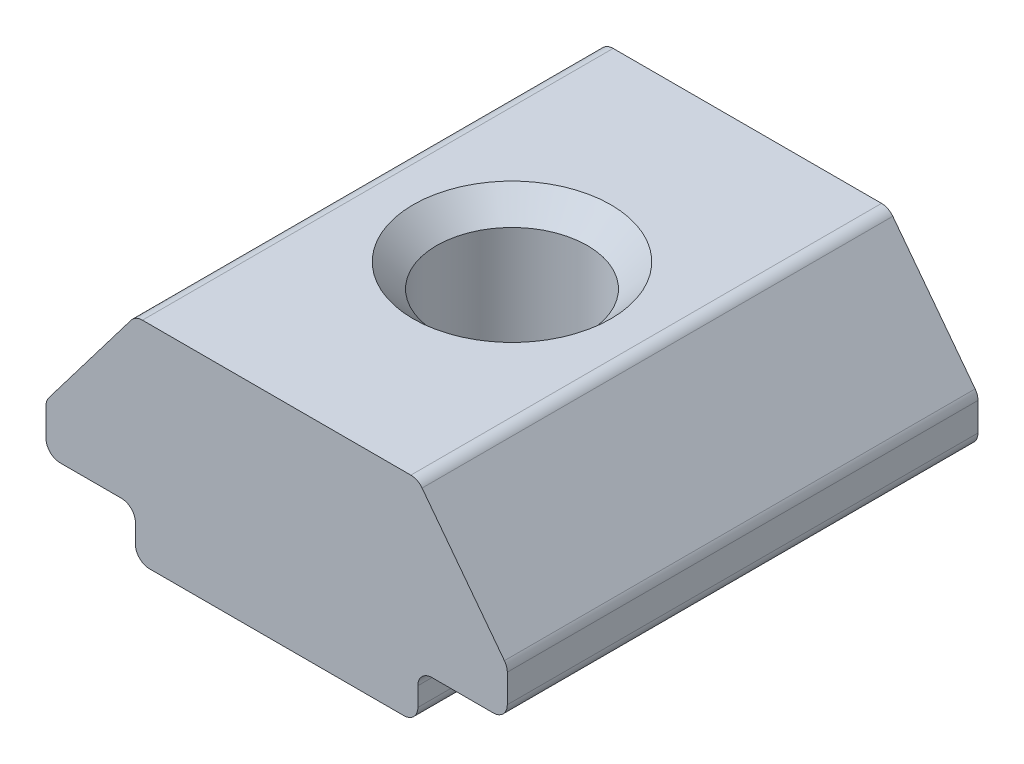
ISO-10303-21;
HEADER;
FILE_DESCRIPTION(('STEP AP214'),'2;1');
FILE_NAME('part.step','',(''),(''),'','','');
FILE_SCHEMA(('AUTOMOTIVE_DESIGN { 1 0 10303 214 1 1 1 1 }'));
ENDSEC;
DATA;
#1=APPLICATION_CONTEXT('core data for automotive mechanical design processes');
#2=APPLICATION_PROTOCOL_DEFINITION('international standard','automotive_design',2000,#1);
#3=PRODUCT_CONTEXT('',#1,'mechanical');
#4=PRODUCT('Part','Part','',(#3));
#5=PRODUCT_RELATED_PRODUCT_CATEGORY('part','',(#4));
#6=PRODUCT_DEFINITION_FORMATION('','',#4);
#7=PRODUCT_DEFINITION_CONTEXT('part definition',#1,'design');
#8=PRODUCT_DEFINITION('design','',#6,#7);
#9=PRODUCT_DEFINITION_SHAPE('','',#8);
#10=(LENGTH_UNIT() NAMED_UNIT(*) SI_UNIT(.MILLI.,.METRE.));
#11=(NAMED_UNIT(*) PLANE_ANGLE_UNIT() SI_UNIT($,.RADIAN.));
#12=(NAMED_UNIT(*) SI_UNIT($,.STERADIAN.) SOLID_ANGLE_UNIT());
#13=UNCERTAINTY_MEASURE_WITH_UNIT(LENGTH_MEASURE(1.E-05),#10,'distance_accuracy_value','');
#14=(GEOMETRIC_REPRESENTATION_CONTEXT(3) GLOBAL_UNCERTAINTY_ASSIGNED_CONTEXT((#13)) GLOBAL_UNIT_ASSIGNED_CONTEXT((#10,
#11,#12)) REPRESENTATION_CONTEXT('',''));
#15=CARTESIAN_POINT('',(0.,0.,0.));
#16=DIRECTION('',(0.,0.,1.));
#17=DIRECTION('',(1.,0.,0.));
#18=AXIS2_PLACEMENT_3D('',#15,#16,#17);
#19=CARTESIAN_POINT('',(-95.2464548456219,-68.7330433621878,164.718531206181));
#20=DIRECTION('',(1.,0.,0.));
#21=DIRECTION('',(0.,0.,-1.));
#22=AXIS2_PLACEMENT_3D('',#19,#20,#21);
#23=PLANE('',#22);
#24=DIRECTION('',(0.,-1.,0.));
#25=VECTOR('',#24,1.);
#26=CARTESIAN_POINT('',(-95.2464548456219,-68.7330433621878,154.718531206181));
#27=LINE('',#26,#25);
#28=CARTESIAN_POINT('',(-95.2464548456219,-69.0330433621878,154.718531206181));
#29=VERTEX_POINT('',#28);
#30=CARTESIAN_POINT('',(-95.2464548456219,-69.4330433621878,154.718531206181));
#31=VERTEX_POINT('',#30);
#32=EDGE_CURVE('E314',#29,#31,#27,.T.);
#33=ORIENTED_EDGE('',*,*,#32,.T.);
#34=DIRECTION('',(0.,0.,-1.));
#35=VECTOR('',#34,1.);
#36=CARTESIAN_POINT('',(-95.2464548456219,-69.4330433621878,164.718531206181));
#37=LINE('',#36,#35);
#38=CARTESIAN_POINT('',(-95.2464548456219,-69.4330433621878,164.718531206181));
#39=VERTEX_POINT('',#38);
#40=EDGE_CURVE('E39',#31,#39,#37,.F.);
#41=ORIENTED_EDGE('',*,*,#40,.T.);
#42=DIRECTION('',(0.,-1.,0.));
#43=VECTOR('',#42,1.);
#44=CARTESIAN_POINT('',(-95.2464548456219,-68.7330433621878,164.718531206181));
#45=LINE('',#44,#43);
#46=CARTESIAN_POINT('',(-95.2464548456219,-69.0330433621878,164.718531206181));
#47=VERTEX_POINT('',#46);
#48=EDGE_CURVE('E183',#47,#39,#45,.T.);
#49=ORIENTED_EDGE('',*,*,#48,.F.);
#50=DIRECTION('',(0.,0.,-1.));
#51=VECTOR('',#50,1.);
#52=CARTESIAN_POINT('',(-95.2464548456219,-69.0330433621878,154.718531206181));
#53=LINE('',#52,#51);
#54=EDGE_CURVE('E257',#47,#29,#53,.T.);
#55=ORIENTED_EDGE('',*,*,#54,.T.);
#56=EDGE_LOOP('',(#33,#41,#49,#55));
#57=FACE_BOUND('',#56,.T.);
#58=ADVANCED_FACE('F16',(#57),#23,.F.);
#59=CARTESIAN_POINT('',(-95.2464548456219,-69.7330433621878,164.718531206181));
#60=DIRECTION('',(0.,1.,0.));
#61=DIRECTION('',(0.,0.,1.));
#62=AXIS2_PLACEMENT_3D('',#59,#60,#61);
#63=PLANE('',#62);
#64=CARTESIAN_POINT('',(-92.2464548456219,-69.7330433621878,159.718531206181));
#65=DIRECTION('',(0.,1.,0.));
#66=DIRECTION('',(0.,0.,1.));
#67=AXIS2_PLACEMENT_3D('',#64,#65,#66);
#68=CIRCLE('',#67,2.1);
#69=CARTESIAN_POINT('',(-92.2464548456219,-69.7330433621878,161.818531206181));
#70=VERTEX_POINT('',#69);
#71=EDGE_CURVE('E10',#70,#70,#68,.T.);
#72=ORIENTED_EDGE('',*,*,#71,.T.);
#73=EDGE_LOOP('',(#72));
#74=FACE_BOUND('',#73,.T.);
#75=DIRECTION('',(1.,0.,0.));
#76=VECTOR('',#75,1.);
#77=CARTESIAN_POINT('',(-95.2464548456219,-69.7330433621878,154.718531206181));
#78=LINE('',#77,#76);
#79=CARTESIAN_POINT('',(-94.9464548456219,-69.7330433621878,154.718531206181));
#80=VERTEX_POINT('',#79);
#81=CARTESIAN_POINT('',(-89.5464548456219,-69.7330433621878,154.718531206181));
#82=VERTEX_POINT('',#81);
#83=EDGE_CURVE('E308',#80,#82,#78,.T.);
#84=ORIENTED_EDGE('',*,*,#83,.T.);
#85=DIRECTION('',(0.,0.,-1.));
#86=VECTOR('',#85,1.);
#87=CARTESIAN_POINT('',(-89.5464548456219,-69.7330433621878,164.718531206181));
#88=LINE('',#87,#86);
#89=CARTESIAN_POINT('',(-89.5464548456219,-69.7330433621878,164.718531206181));
#90=VERTEX_POINT('',#89);
#91=EDGE_CURVE('E251',#82,#90,#88,.F.);
#92=ORIENTED_EDGE('',*,*,#91,.T.);
#93=DIRECTION('',(1.,0.,0.));
#94=VECTOR('',#93,1.);
#95=CARTESIAN_POINT('',(-95.2464548456219,-69.7330433621878,164.718531206181));
#96=LINE('',#95,#94);
#97=CARTESIAN_POINT('',(-94.9464548456219,-69.7330433621878,164.718531206181));
#98=VERTEX_POINT('',#97);
#99=EDGE_CURVE('E186',#98,#90,#96,.T.);
#100=ORIENTED_EDGE('',*,*,#99,.F.);
#101=DIRECTION('',(0.,0.,-1.));
#102=VECTOR('',#101,1.);
#103=CARTESIAN_POINT('',(-94.9464548456219,-69.7330433621878,164.718531206181));
#104=LINE('',#103,#102);
#105=EDGE_CURVE('E248',#98,#80,#104,.T.);
#106=ORIENTED_EDGE('',*,*,#105,.T.);
#107=EDGE_LOOP('',(#84,#92,#100,#106));
#108=FACE_BOUND('',#107,.T.);
#109=ADVANCED_FACE('F301',(#74,#108),#63,.F.);
#110=CARTESIAN_POINT('',(-89.2464548456219,-69.7330433621878,164.718531206181));
#111=DIRECTION('',(-1.,0.,0.));
#112=DIRECTION('',(0.,0.,1.));
#113=AXIS2_PLACEMENT_3D('',#110,#111,#112);
#114=PLANE('',#113);
#115=DIRECTION('',(0.,1.,0.));
#116=VECTOR('',#115,1.);
#117=CARTESIAN_POINT('',(-89.2464548456219,-69.7330433621878,164.718531206181));
#118=LINE('',#117,#116);
#119=CARTESIAN_POINT('',(-89.2464548456219,-69.4330433621878,164.718531206181));
#120=VERTEX_POINT('',#119);
#121=CARTESIAN_POINT('',(-89.2464548456219,-69.0330433621878,164.718531206181));
#122=VERTEX_POINT('',#121);
#123=EDGE_CURVE('E321',#120,#122,#118,.T.);
#124=ORIENTED_EDGE('',*,*,#123,.F.);
#125=DIRECTION('',(0.,0.,-1.));
#126=VECTOR('',#125,1.);
#127=CARTESIAN_POINT('',(-89.2464548456219,-69.4330433621878,164.718531206181));
#128=LINE('',#127,#126);
#129=CARTESIAN_POINT('',(-89.2464548456219,-69.4330433621878,154.718531206181));
#130=VERTEX_POINT('',#129);
#131=EDGE_CURVE('E241',#120,#130,#128,.T.);
#132=ORIENTED_EDGE('',*,*,#131,.T.);
#133=DIRECTION('',(0.,1.,0.));
#134=VECTOR('',#133,1.);
#135=CARTESIAN_POINT('',(-89.2464548456219,-69.7330433621878,154.718531206181));
#136=LINE('',#135,#134);
#137=CARTESIAN_POINT('',(-89.2464548456219,-69.0330433621878,154.718531206181));
#138=VERTEX_POINT('',#137);
#139=EDGE_CURVE('E313',#130,#138,#136,.T.);
#140=ORIENTED_EDGE('',*,*,#139,.T.);
#141=DIRECTION('',(0.,0.,-1.));
#142=VECTOR('',#141,1.);
#143=CARTESIAN_POINT('',(-89.2464548456219,-69.0330433621878,164.718531206181));
#144=LINE('',#143,#142);
#145=EDGE_CURVE('E239',#138,#122,#144,.F.);
#146=ORIENTED_EDGE('',*,*,#145,.T.);
#147=EDGE_LOOP('',(#124,#132,#140,#146));
#148=FACE_BOUND('',#147,.T.);
#149=ADVANCED_FACE('F304',(#148),#114,.F.);
#150=CARTESIAN_POINT('',(-89.2464548456219,-68.7330433621878,164.718531206181));
#151=DIRECTION('',(0.,1.,0.));
#152=DIRECTION('',(0.,0.,1.));
#153=AXIS2_PLACEMENT_3D('',#150,#151,#152);
#154=PLANE('',#153);
#155=DIRECTION('',(1.,0.,0.));
#156=VECTOR('',#155,1.);
#157=CARTESIAN_POINT('',(-89.2464548456219,-68.7330433621878,164.718531206181));
#158=LINE('',#157,#156);
#159=CARTESIAN_POINT('',(-88.9464548456219,-68.7330433621878,164.718531206181));
#160=VERTEX_POINT('',#159);
#161=CARTESIAN_POINT('',(-87.6464548456219,-68.7330433621878,164.718531206181));
#162=VERTEX_POINT('',#161);
#163=EDGE_CURVE('E325',#160,#162,#158,.T.);
#164=ORIENTED_EDGE('',*,*,#163,.F.);
#165=DIRECTION('',(0.,0.,-1.));
#166=VECTOR('',#165,1.);
#167=CARTESIAN_POINT('',(-88.9464548456219,-68.7330433621878,154.718531206181));
#168=LINE('',#167,#166);
#169=CARTESIAN_POINT('',(-88.9464548456219,-68.7330433621878,154.718531206181));
#170=VERTEX_POINT('',#169);
#171=EDGE_CURVE('E261',#160,#170,#168,.T.);
#172=ORIENTED_EDGE('',*,*,#171,.T.);
#173=DIRECTION('',(1.,0.,0.));
#174=VECTOR('',#173,1.);
#175=CARTESIAN_POINT('',(-89.2464548456219,-68.7330433621878,154.718531206181));
#176=LINE('',#175,#174);
#177=CARTESIAN_POINT('',(-87.6464548456219,-68.7330433621878,154.718531206181));
#178=VERTEX_POINT('',#177);
#179=EDGE_CURVE('E348',#170,#178,#176,.T.);
#180=ORIENTED_EDGE('',*,*,#179,.T.);
#181=DIRECTION('',(0.,0.,-1.));
#182=VECTOR('',#181,1.);
#183=CARTESIAN_POINT('',(-87.6464548456219,-68.7330433621878,164.718531206181));
#184=LINE('',#183,#182);
#185=EDGE_CURVE('E236',#178,#162,#184,.F.);
#186=ORIENTED_EDGE('',*,*,#185,.T.);
#187=EDGE_LOOP('',(#164,#172,#180,#186));
#188=FACE_BOUND('',#187,.T.);
#189=ADVANCED_FACE('F549',(#188),#154,.F.);
#190=CARTESIAN_POINT('',(-87.3464548456219,-68.7330433621878,164.718531206181));
#191=DIRECTION('',(-1.,0.,0.));
#192=DIRECTION('',(0.,0.,1.));
#193=AXIS2_PLACEMENT_3D('',#190,#191,#192);
#194=PLANE('',#193);
#195=DIRECTION('',(0.,1.,0.));
#196=VECTOR('',#195,1.);
#197=CARTESIAN_POINT('',(-87.3464548456219,-68.7330433621878,154.718531206181));
#198=LINE('',#197,#196);
#199=CARTESIAN_POINT('',(-87.3464548456219,-68.4330433621878,154.718531206181));
#200=VERTEX_POINT('',#199);
#201=CARTESIAN_POINT('',(-87.3464548456219,-67.8341060506544,154.718531206181));
#202=VERTEX_POINT('',#201);
#203=EDGE_CURVE('E350',#200,#202,#198,.T.);
#204=ORIENTED_EDGE('',*,*,#203,.T.);
#205=DIRECTION('',(0.,0.,-1.));
#206=VECTOR('',#205,1.);
#207=CARTESIAN_POINT('',(-87.3464548456219,-67.8341060506544,164.718531206181));
#208=LINE('',#207,#206);
#209=CARTESIAN_POINT('',(-87.3464548456219,-67.8341060506544,164.718531206181));
#210=VERTEX_POINT('',#209);
#211=EDGE_CURVE('E234',#202,#210,#208,.F.);
#212=ORIENTED_EDGE('',*,*,#211,.T.);
#213=DIRECTION('',(0.,1.,0.));
#214=VECTOR('',#213,1.);
#215=CARTESIAN_POINT('',(-87.3464548456219,-68.7330433621878,164.718531206181));
#216=LINE('',#215,#214);
#217=CARTESIAN_POINT('',(-87.3464548456219,-68.4330433621878,164.718531206181));
#218=VERTEX_POINT('',#217);
#219=EDGE_CURVE('E327',#218,#210,#216,.T.);
#220=ORIENTED_EDGE('',*,*,#219,.F.);
#221=DIRECTION('',(0.,0.,-1.));
#222=VECTOR('',#221,1.);
#223=CARTESIAN_POINT('',(-87.3464548456219,-68.4330433621878,164.718531206181));
#224=LINE('',#223,#222);
#225=EDGE_CURVE('E231',#218,#200,#224,.T.);
#226=ORIENTED_EDGE('',*,*,#225,.T.);
#227=EDGE_LOOP('',(#204,#212,#220,#226));
#228=FACE_BOUND('',#227,.T.);
#229=ADVANCED_FACE('F540',(#228),#194,.F.);
#230=CARTESIAN_POINT('',(-87.3464548456219,-67.7330433621878,164.718531206181));
#231=DIRECTION('',(-0.796162194123102,-0.605083267533558,0.));
#232=DIRECTION('',(0.605083267533558,-0.796162194123102,0.));
#233=AXIS2_PLACEMENT_3D('',#230,#231,#232);
#234=PLANE('',#233);
#235=DIRECTION('',(-0.605083267533558,0.796162194123102,0.));
#236=VECTOR('',#235,1.);
#237=CARTESIAN_POINT('',(-87.3464548456219,-67.7330433621878,154.718531206181));
#238=LINE('',#237,#236);
#239=CARTESIAN_POINT('',(-87.407606187385,-67.6525810703943,154.718531206181));
#240=VERTEX_POINT('',#239);
#241=CARTESIAN_POINT('',(-89.1564138306195,-65.3515183819277,154.718531206181));
#242=VERTEX_POINT('',#241);
#243=EDGE_CURVE('E353',#240,#242,#238,.T.);
#244=ORIENTED_EDGE('',*,*,#243,.T.);
#245=DIRECTION('',(0.,0.,-1.));
#246=VECTOR('',#245,1.);
#247=CARTESIAN_POINT('',(-89.1564138306195,-65.3515183819277,164.718531206181));
#248=LINE('',#247,#246);
#249=CARTESIAN_POINT('',(-89.1564138306195,-65.3515183819277,164.718531206181));
#250=VERTEX_POINT('',#249);
#251=EDGE_CURVE('E229',#242,#250,#248,.F.);
#252=ORIENTED_EDGE('',*,*,#251,.T.);
#253=DIRECTION('',(-0.605083267533558,0.796162194123102,0.));
#254=VECTOR('',#253,1.);
#255=CARTESIAN_POINT('',(-87.3464548456219,-67.7330433621878,164.718531206181));
#256=LINE('',#255,#254);
#257=CARTESIAN_POINT('',(-87.407606187385,-67.6525810703943,164.718531206181));
#258=VERTEX_POINT('',#257);
#259=EDGE_CURVE('E333',#258,#250,#256,.T.);
#260=ORIENTED_EDGE('',*,*,#259,.F.);
#261=DIRECTION('',(0.,0.,-1.));
#262=VECTOR('',#261,1.);
#263=CARTESIAN_POINT('',(-87.407606187385,-67.6525810703943,164.718531206181));
#264=LINE('',#263,#262);
#265=EDGE_CURVE('E226',#258,#240,#264,.T.);
#266=ORIENTED_EDGE('',*,*,#265,.T.);
#267=EDGE_LOOP('',(#244,#252,#260,#266));
#268=FACE_BOUND('',#267,.T.);
#269=ADVANCED_FACE('F532',(#268),#234,.F.);
#270=CARTESIAN_POINT('',(-89.2464548456219,-65.2330433621878,164.718531206181));
#271=DIRECTION('',(0.,-1.,0.));
#272=DIRECTION('',(0.,0.,-1.));
#273=AXIS2_PLACEMENT_3D('',#270,#271,#272);
#274=PLANE('',#273);
#275=CARTESIAN_POINT('',(-92.2464548456219,-65.2330433621878,159.718531206181));
#276=DIRECTION('',(0.,-1.,0.));
#277=DIRECTION('',(0.,0.,-1.));
#278=AXIS2_PLACEMENT_3D('',#275,#276,#277);
#279=CIRCLE('',#278,2.10000000000001);
#280=CARTESIAN_POINT('',(-92.2464548456219,-65.2330433621878,157.618531206181));
#281=VERTEX_POINT('',#280);
#282=EDGE_CURVE('E24',#281,#281,#279,.T.);
#283=ORIENTED_EDGE('',*,*,#282,.T.);
#284=EDGE_LOOP('',(#283));
#285=FACE_BOUND('',#284,.T.);
#286=DIRECTION('',(-1.,0.,0.));
#287=VECTOR('',#286,1.);
#288=CARTESIAN_POINT('',(-89.2464548456219,-65.2330433621878,154.718531206181));
#289=LINE('',#288,#287);
#290=CARTESIAN_POINT('',(-89.3952624888565,-65.2330433621878,154.718531206181));
#291=VERTEX_POINT('',#290);
#292=CARTESIAN_POINT('',(-95.0976472023873,-65.2330433621878,154.718531206181));
#293=VERTEX_POINT('',#292);
#294=EDGE_CURVE('E356',#291,#293,#289,.T.);
#295=ORIENTED_EDGE('',*,*,#294,.T.);
#296=DIRECTION('',(0.,0.,-1.));
#297=VECTOR('',#296,1.);
#298=CARTESIAN_POINT('',(-95.0976472023873,-65.2330433621878,164.718531206181));
#299=LINE('',#298,#297);
#300=CARTESIAN_POINT('',(-95.0976472023873,-65.2330433621878,164.718531206181));
#301=VERTEX_POINT('',#300);
#302=EDGE_CURVE('E224',#293,#301,#299,.F.);
#303=ORIENTED_EDGE('',*,*,#302,.T.);
#304=DIRECTION('',(-1.,0.,0.));
#305=VECTOR('',#304,1.);
#306=CARTESIAN_POINT('',(-89.2464548456219,-65.2330433621878,164.718531206181));
#307=LINE('',#306,#305);
#308=CARTESIAN_POINT('',(-89.3952624888565,-65.2330433621878,164.718531206181));
#309=VERTEX_POINT('',#308);
#310=EDGE_CURVE('E336',#309,#301,#307,.T.);
#311=ORIENTED_EDGE('',*,*,#310,.F.);
#312=DIRECTION('',(0.,0.,-1.));
#313=VECTOR('',#312,1.);
#314=CARTESIAN_POINT('',(-89.3952624888565,-65.2330433621878,164.718531206181));
#315=LINE('',#314,#313);
#316=EDGE_CURVE('E221',#309,#291,#315,.T.);
#317=ORIENTED_EDGE('',*,*,#316,.T.);
#318=EDGE_LOOP('',(#295,#303,#311,#317));
#319=FACE_BOUND('',#318,.T.);
#320=ADVANCED_FACE('F280',(#285,#319),#274,.F.);
#321=CARTESIAN_POINT('',(-97.1464548456219,-67.7330433621878,164.718531206181));
#322=DIRECTION('',(0.796162194123102,-0.605083267533558,0.));
#323=DIRECTION('',(0.605083267533558,0.796162194123102,0.));
#324=AXIS2_PLACEMENT_3D('',#321,#322,#323);
#325=PLANE('',#324);
#326=DIRECTION('',(-0.605083267533558,-0.796162194123102,0.));
#327=VECTOR('',#326,1.);
#328=CARTESIAN_POINT('',(-97.1464548456219,-67.7330433621878,154.718531206181));
#329=LINE('',#328,#327);
#330=CARTESIAN_POINT('',(-95.3364958606242,-65.3515183819277,154.718531206181));
#331=VERTEX_POINT('',#330);
#332=CARTESIAN_POINT('',(-97.0853035038588,-67.6525810703943,154.718531206181));
#333=VERTEX_POINT('',#332);
#334=EDGE_CURVE('E188',#331,#333,#329,.T.);
#335=ORIENTED_EDGE('',*,*,#334,.T.);
#336=DIRECTION('',(0.,0.,-1.));
#337=VECTOR('',#336,1.);
#338=CARTESIAN_POINT('',(-97.0853035038588,-67.6525810703943,164.718531206181));
#339=LINE('',#338,#337);
#340=CARTESIAN_POINT('',(-97.0853035038588,-67.6525810703943,164.718531206181));
#341=VERTEX_POINT('',#340);
#342=EDGE_CURVE('E219',#333,#341,#339,.F.);
#343=ORIENTED_EDGE('',*,*,#342,.T.);
#344=DIRECTION('',(-0.605083267533558,-0.796162194123102,0.));
#345=VECTOR('',#344,1.);
#346=CARTESIAN_POINT('',(-97.1464548456219,-67.7330433621878,164.718531206181));
#347=LINE('',#346,#345);
#348=CARTESIAN_POINT('',(-95.3364958606242,-65.3515183819277,164.718531206181));
#349=VERTEX_POINT('',#348);
#350=EDGE_CURVE('E339',#349,#341,#347,.T.);
#351=ORIENTED_EDGE('',*,*,#350,.F.);
#352=DIRECTION('',(0.,0.,-1.));
#353=VECTOR('',#352,1.);
#354=CARTESIAN_POINT('',(-95.3364958606242,-65.3515183819277,164.718531206181));
#355=LINE('',#354,#353);
#356=EDGE_CURVE('E216',#349,#331,#355,.T.);
#357=ORIENTED_EDGE('',*,*,#356,.T.);
#358=EDGE_LOOP('',(#335,#343,#351,#357));
#359=FACE_BOUND('',#358,.T.);
#360=ADVANCED_FACE('F362',(#359),#325,.F.);
#361=CARTESIAN_POINT('',(-97.1464548456219,-68.7330433621878,164.718531206181));
#362=DIRECTION('',(1.,0.,0.));
#363=DIRECTION('',(0.,0.,-1.));
#364=AXIS2_PLACEMENT_3D('',#361,#362,#363);
#365=PLANE('',#364);
#366=DIRECTION('',(0.,-1.,0.));
#367=VECTOR('',#366,1.);
#368=CARTESIAN_POINT('',(-97.1464548456219,-68.7330433621878,154.718531206181));
#369=LINE('',#368,#367);
#370=CARTESIAN_POINT('',(-97.1464548456219,-67.8341060506544,154.718531206181));
#371=VERTEX_POINT('',#370);
#372=CARTESIAN_POINT('',(-97.1464548456219,-68.4330433621878,154.718531206181));
#373=VERTEX_POINT('',#372);
#374=EDGE_CURVE('E184',#371,#373,#369,.T.);
#375=ORIENTED_EDGE('',*,*,#374,.T.);
#376=DIRECTION('',(0.,0.,-1.));
#377=VECTOR('',#376,1.);
#378=CARTESIAN_POINT('',(-97.1464548456219,-68.4330433621878,164.718531206181));
#379=LINE('',#378,#377);
#380=CARTESIAN_POINT('',(-97.1464548456219,-68.4330433621878,164.718531206181));
#381=VERTEX_POINT('',#380);
#382=EDGE_CURVE('E161',#373,#381,#379,.F.);
#383=ORIENTED_EDGE('',*,*,#382,.T.);
#384=DIRECTION('',(0.,-1.,0.));
#385=VECTOR('',#384,1.);
#386=CARTESIAN_POINT('',(-97.1464548456219,-68.7330433621878,164.718531206181));
#387=LINE('',#386,#385);
#388=CARTESIAN_POINT('',(-97.1464548456219,-67.8341060506544,164.718531206181));
#389=VERTEX_POINT('',#388);
#390=EDGE_CURVE('E342',#389,#381,#387,.T.);
#391=ORIENTED_EDGE('',*,*,#390,.F.);
#392=DIRECTION('',(0.,0.,-1.));
#393=VECTOR('',#392,1.);
#394=CARTESIAN_POINT('',(-97.1464548456219,-67.8341060506544,164.718531206181));
#395=LINE('',#394,#393);
#396=EDGE_CURVE('E166',#389,#371,#395,.T.);
#397=ORIENTED_EDGE('',*,*,#396,.T.);
#398=EDGE_LOOP('',(#375,#383,#391,#397));
#399=FACE_BOUND('',#398,.T.);
#400=ADVANCED_FACE('F371',(#399),#365,.F.);
#401=CARTESIAN_POINT('',(-97.1464548456219,-68.7330433621878,164.718531206181));
#402=DIRECTION('',(0.,1.,0.));
#403=DIRECTION('',(0.,0.,1.));
#404=AXIS2_PLACEMENT_3D('',#401,#402,#403);
#405=PLANE('',#404);
#406=DIRECTION('',(1.,0.,0.));
#407=VECTOR('',#406,1.);
#408=CARTESIAN_POINT('',(-97.1464548456219,-68.7330433621878,154.718531206181));
#409=LINE('',#408,#407);
#410=CARTESIAN_POINT('',(-96.8464548456219,-68.7330433621878,154.718531206181));
#411=VERTEX_POINT('',#410);
#412=CARTESIAN_POINT('',(-95.5464548456219,-68.7330433621878,154.718531206181));
#413=VERTEX_POINT('',#412);
#414=EDGE_CURVE('E173',#411,#413,#409,.T.);
#415=ORIENTED_EDGE('',*,*,#414,.T.);
#416=DIRECTION('',(0.,0.,-1.));
#417=VECTOR('',#416,1.);
#418=CARTESIAN_POINT('',(-95.5464548456219,-68.7330433621878,164.718531206181));
#419=LINE('',#418,#417);
#420=CARTESIAN_POINT('',(-95.5464548456219,-68.7330433621878,164.718531206181));
#421=VERTEX_POINT('',#420);
#422=EDGE_CURVE('E264',#413,#421,#419,.F.);
#423=ORIENTED_EDGE('',*,*,#422,.T.);
#424=DIRECTION('',(1.,0.,0.));
#425=VECTOR('',#424,1.);
#426=CARTESIAN_POINT('',(-97.1464548456219,-68.7330433621878,164.718531206181));
#427=LINE('',#426,#425);
#428=CARTESIAN_POINT('',(-96.8464548456219,-68.7330433621878,164.718531206181));
#429=VERTEX_POINT('',#428);
#430=EDGE_CURVE('E176',#429,#421,#427,.T.);
#431=ORIENTED_EDGE('',*,*,#430,.F.);
#432=DIRECTION('',(0.,0.,-1.));
#433=VECTOR('',#432,1.);
#434=CARTESIAN_POINT('',(-96.8464548456219,-68.7330433621878,164.718531206181));
#435=LINE('',#434,#433);
#436=EDGE_CURVE('E160',#429,#411,#435,.T.);
#437=ORIENTED_EDGE('',*,*,#436,.T.);
#438=EDGE_LOOP('',(#415,#423,#431,#437));
#439=FACE_BOUND('',#438,.T.);
#440=ADVANCED_FACE('F172',(#439),#405,.F.);
#441=CARTESIAN_POINT('',(-92.2464548456219,-69.7330433621878,164.718531206181));
#442=DIRECTION('',(0.,0.,1.));
#443=DIRECTION('',(1.,0.,0.));
#444=AXIS2_PLACEMENT_3D('',#441,#442,#443);
#445=PLANE('',#444);
#446=ORIENTED_EDGE('',*,*,#99,.T.);
#447=CARTESIAN_POINT('',(-89.5464548456219,-69.4330433621878,164.718531206181));
#448=DIRECTION('',(0.,0.,1.));
#449=DIRECTION('',(1.,0.,0.));
#450=AXIS2_PLACEMENT_3D('',#447,#448,#449);
#451=CIRCLE('',#450,0.3);
#452=EDGE_CURVE('E255',#90,#120,#451,.T.);
#453=ORIENTED_EDGE('',*,*,#452,.T.);
#454=ORIENTED_EDGE('',*,*,#123,.T.);
#455=CARTESIAN_POINT('',(-88.9464548456219,-69.0330433621878,164.718531206181));
#456=DIRECTION('',(0.,0.,1.));
#457=DIRECTION('',(1.,0.,0.));
#458=AXIS2_PLACEMENT_3D('',#455,#456,#457);
#459=CIRCLE('',#458,0.3);
#460=EDGE_CURVE('E31',#122,#160,#459,.F.);
#461=ORIENTED_EDGE('',*,*,#460,.T.);
#462=ORIENTED_EDGE('',*,*,#163,.T.);
#463=CARTESIAN_POINT('',(-87.6464548456219,-68.4330433621878,164.718531206181));
#464=DIRECTION('',(0.,0.,1.));
#465=DIRECTION('',(1.,0.,0.));
#466=AXIS2_PLACEMENT_3D('',#463,#464,#465);
#467=CIRCLE('',#466,0.3);
#468=EDGE_CURVE('E204',#162,#218,#467,.T.);
#469=ORIENTED_EDGE('',*,*,#468,.T.);
#470=ORIENTED_EDGE('',*,*,#219,.T.);
#471=CARTESIAN_POINT('',(-87.6464548456219,-67.8341060506544,164.718531206181));
#472=DIRECTION('',(0.,0.,1.));
#473=DIRECTION('',(1.,0.,0.));
#474=AXIS2_PLACEMENT_3D('',#471,#472,#473);
#475=CIRCLE('',#474,0.3);
#476=EDGE_CURVE('E206',#210,#258,#475,.T.);
#477=ORIENTED_EDGE('',*,*,#476,.T.);
#478=ORIENTED_EDGE('',*,*,#259,.T.);
#479=CARTESIAN_POINT('',(-89.3952624888565,-65.5330433621878,164.718531206181));
#480=DIRECTION('',(0.,0.,1.));
#481=DIRECTION('',(1.,0.,0.));
#482=AXIS2_PLACEMENT_3D('',#479,#480,#481);
#483=CIRCLE('',#482,0.3);
#484=EDGE_CURVE('E208',#250,#309,#483,.T.);
#485=ORIENTED_EDGE('',*,*,#484,.T.);
#486=ORIENTED_EDGE('',*,*,#310,.T.);
#487=CARTESIAN_POINT('',(-95.0976472023873,-65.5330433621878,164.718531206181));
#488=DIRECTION('',(0.,0.,1.));
#489=DIRECTION('',(1.,0.,0.));
#490=AXIS2_PLACEMENT_3D('',#487,#488,#489);
#491=CIRCLE('',#490,0.3);
#492=EDGE_CURVE('E210',#301,#349,#491,.T.);
#493=ORIENTED_EDGE('',*,*,#492,.T.);
#494=ORIENTED_EDGE('',*,*,#350,.T.);
#495=CARTESIAN_POINT('',(-96.8464548456219,-67.8341060506544,164.718531206181));
#496=DIRECTION('',(0.,0.,1.));
#497=DIRECTION('',(1.,0.,0.));
#498=AXIS2_PLACEMENT_3D('',#495,#496,#497);
#499=CIRCLE('',#498,0.3);
#500=EDGE_CURVE('E212',#341,#389,#499,.T.);
#501=ORIENTED_EDGE('',*,*,#500,.T.);
#502=ORIENTED_EDGE('',*,*,#390,.T.);
#503=CARTESIAN_POINT('',(-96.8464548456219,-68.4330433621878,164.718531206181));
#504=DIRECTION('',(0.,0.,1.));
#505=DIRECTION('',(1.,0.,0.));
#506=AXIS2_PLACEMENT_3D('',#503,#504,#505);
#507=CIRCLE('',#506,0.3);
#508=EDGE_CURVE('E214',#381,#429,#507,.T.);
#509=ORIENTED_EDGE('',*,*,#508,.T.);
#510=ORIENTED_EDGE('',*,*,#430,.T.);
#511=CARTESIAN_POINT('',(-95.5464548456219,-69.0330433621878,164.718531206181));
#512=DIRECTION('',(0.,0.,1.));
#513=DIRECTION('',(1.,0.,0.));
#514=AXIS2_PLACEMENT_3D('',#511,#512,#513);
#515=CIRCLE('',#514,0.3);
#516=EDGE_CURVE('E270',#421,#47,#515,.F.);
#517=ORIENTED_EDGE('',*,*,#516,.T.);
#518=ORIENTED_EDGE('',*,*,#48,.T.);
#519=CARTESIAN_POINT('',(-94.9464548456219,-69.4330433621878,164.718531206181));
#520=DIRECTION('',(0.,0.,1.));
#521=DIRECTION('',(1.,0.,0.));
#522=AXIS2_PLACEMENT_3D('',#519,#520,#521);
#523=CIRCLE('',#522,0.3);
#524=EDGE_CURVE('E253',#39,#98,#523,.T.);
#525=ORIENTED_EDGE('',*,*,#524,.T.);
#526=EDGE_LOOP('',(#446,#453,#454,#461,#462,#469,#470,#477,#478,#485,#486,#493,#494,#501,#502,
#509,#510,#517,#518,#525));
#527=FACE_BOUND('',#526,.T.);
#528=ADVANCED_FACE('F320',(#527),#445,.T.);
#529=CARTESIAN_POINT('',(-92.2464548456219,-69.7330433621878,154.718531206181));
#530=DIRECTION('',(0.,0.,1.));
#531=DIRECTION('',(1.,0.,0.));
#532=AXIS2_PLACEMENT_3D('',#529,#530,#531);
#533=PLANE('',#532);
#534=ORIENTED_EDGE('',*,*,#139,.F.);
#535=CARTESIAN_POINT('',(-89.5464548456219,-69.4330433621878,154.718531206181));
#536=DIRECTION('',(0.,0.,1.));
#537=DIRECTION('',(1.,0.,0.));
#538=AXIS2_PLACEMENT_3D('',#535,#536,#537);
#539=CIRCLE('',#538,0.3);
#540=EDGE_CURVE('E246',#130,#82,#539,.F.);
#541=ORIENTED_EDGE('',*,*,#540,.T.);
#542=ORIENTED_EDGE('',*,*,#83,.F.);
#543=CARTESIAN_POINT('',(-94.9464548456219,-69.4330433621878,154.718531206181));
#544=DIRECTION('',(0.,0.,1.));
#545=DIRECTION('',(1.,0.,0.));
#546=AXIS2_PLACEMENT_3D('',#543,#544,#545);
#547=CIRCLE('',#546,0.3);
#548=EDGE_CURVE('E244',#80,#31,#547,.F.);
#549=ORIENTED_EDGE('',*,*,#548,.T.);
#550=ORIENTED_EDGE('',*,*,#32,.F.);
#551=CARTESIAN_POINT('',(-95.5464548456219,-69.0330433621878,154.718531206181));
#552=DIRECTION('',(0.,0.,1.));
#553=DIRECTION('',(1.,0.,0.));
#554=AXIS2_PLACEMENT_3D('',#551,#552,#553);
#555=CIRCLE('',#554,0.3);
#556=EDGE_CURVE('E182',#29,#413,#555,.T.);
#557=ORIENTED_EDGE('',*,*,#556,.T.);
#558=ORIENTED_EDGE('',*,*,#414,.F.);
#559=CARTESIAN_POINT('',(-96.8464548456219,-68.4330433621878,154.718531206181));
#560=DIRECTION('',(0.,0.,1.));
#561=DIRECTION('',(1.,0.,0.));
#562=AXIS2_PLACEMENT_3D('',#559,#560,#561);
#563=CIRCLE('',#562,0.3);
#564=EDGE_CURVE('E156',#411,#373,#563,.F.);
#565=ORIENTED_EDGE('',*,*,#564,.T.);
#566=ORIENTED_EDGE('',*,*,#374,.F.);
#567=CARTESIAN_POINT('',(-96.8464548456219,-67.8341060506544,154.718531206181));
#568=DIRECTION('',(0.,0.,1.));
#569=DIRECTION('',(1.,0.,0.));
#570=AXIS2_PLACEMENT_3D('',#567,#568,#569);
#571=CIRCLE('',#570,0.3);
#572=EDGE_CURVE('E167',#371,#333,#571,.F.);
#573=ORIENTED_EDGE('',*,*,#572,.T.);
#574=ORIENTED_EDGE('',*,*,#334,.F.);
#575=CARTESIAN_POINT('',(-95.0976472023873,-65.5330433621878,154.718531206181));
#576=DIRECTION('',(0.,0.,1.));
#577=DIRECTION('',(1.,0.,0.));
#578=AXIS2_PLACEMENT_3D('',#575,#576,#577);
#579=CIRCLE('',#578,0.3);
#580=EDGE_CURVE('E198',#331,#293,#579,.F.);
#581=ORIENTED_EDGE('',*,*,#580,.T.);
#582=ORIENTED_EDGE('',*,*,#294,.F.);
#583=CARTESIAN_POINT('',(-89.3952624888565,-65.5330433621878,154.718531206181));
#584=DIRECTION('',(0.,0.,1.));
#585=DIRECTION('',(1.,0.,0.));
#586=AXIS2_PLACEMENT_3D('',#583,#584,#585);
#587=CIRCLE('',#586,0.3);
#588=EDGE_CURVE('E196',#291,#242,#587,.F.);
#589=ORIENTED_EDGE('',*,*,#588,.T.);
#590=ORIENTED_EDGE('',*,*,#243,.F.);
#591=CARTESIAN_POINT('',(-87.6464548456219,-67.8341060506544,154.718531206181));
#592=DIRECTION('',(0.,0.,1.));
#593=DIRECTION('',(1.,0.,0.));
#594=AXIS2_PLACEMENT_3D('',#591,#592,#593);
#595=CIRCLE('',#594,0.3);
#596=EDGE_CURVE('E194',#240,#202,#595,.F.);
#597=ORIENTED_EDGE('',*,*,#596,.T.);
#598=ORIENTED_EDGE('',*,*,#203,.F.);
#599=CARTESIAN_POINT('',(-87.6464548456219,-68.4330433621878,154.718531206181));
#600=DIRECTION('',(0.,0.,1.));
#601=DIRECTION('',(1.,0.,0.));
#602=AXIS2_PLACEMENT_3D('',#599,#600,#601);
#603=CIRCLE('',#602,0.3);
#604=EDGE_CURVE('E177',#200,#178,#603,.F.);
#605=ORIENTED_EDGE('',*,*,#604,.T.);
#606=ORIENTED_EDGE('',*,*,#179,.F.);
#607=CARTESIAN_POINT('',(-88.9464548456219,-69.0330433621878,154.718531206181));
#608=DIRECTION('',(0.,0.,1.));
#609=DIRECTION('',(1.,0.,0.));
#610=AXIS2_PLACEMENT_3D('',#607,#608,#609);
#611=CIRCLE('',#610,0.3);
#612=EDGE_CURVE('E266',#170,#138,#611,.T.);
#613=ORIENTED_EDGE('',*,*,#612,.T.);
#614=EDGE_LOOP('',(#534,#541,#542,#549,#550,#557,#558,#565,#566,#573,#574,#581,#582,#589,#590,
#597,#598,#605,#606,#613));
#615=FACE_BOUND('',#614,.T.);
#616=ADVANCED_FACE('F180',(#615),#533,.F.);
#617=CARTESIAN_POINT('',(-96.8464548456219,-68.4330433621878,164.718531206181));
#618=DIRECTION('',(0.,0.,-1.));
#619=DIRECTION('',(-1.,0.,0.));
#620=AXIS2_PLACEMENT_3D('',#617,#618,#619);
#621=CYLINDRICAL_SURFACE('',#620,0.3);
#622=ORIENTED_EDGE('',*,*,#508,.F.);
#623=ORIENTED_EDGE('',*,*,#382,.F.);
#624=ORIENTED_EDGE('',*,*,#564,.F.);
#625=ORIENTED_EDGE('',*,*,#436,.F.);
#626=EDGE_LOOP('',(#622,#623,#624,#625));
#627=FACE_BOUND('',#626,.T.);
#628=ADVANCED_FACE('F159',(#627),#621,.T.);
#629=CARTESIAN_POINT('',(-96.8464548456219,-67.8341060506544,164.718531206181));
#630=DIRECTION('',(0.,0.,-1.));
#631=DIRECTION('',(-1.,0.,0.));
#632=AXIS2_PLACEMENT_3D('',#629,#630,#631);
#633=CYLINDRICAL_SURFACE('',#632,0.3);
#634=ORIENTED_EDGE('',*,*,#500,.F.);
#635=ORIENTED_EDGE('',*,*,#342,.F.);
#636=ORIENTED_EDGE('',*,*,#572,.F.);
#637=ORIENTED_EDGE('',*,*,#396,.F.);
#638=EDGE_LOOP('',(#634,#635,#636,#637));
#639=FACE_BOUND('',#638,.T.);
#640=ADVANCED_FACE('F367',(#639),#633,.T.);
#641=CARTESIAN_POINT('',(-95.0976472023873,-65.5330433621878,164.718531206181));
#642=DIRECTION('',(0.,0.,-1.));
#643=DIRECTION('',(-1.,0.,0.));
#644=AXIS2_PLACEMENT_3D('',#641,#642,#643);
#645=CYLINDRICAL_SURFACE('',#644,0.3);
#646=ORIENTED_EDGE('',*,*,#492,.F.);
#647=ORIENTED_EDGE('',*,*,#302,.F.);
#648=ORIENTED_EDGE('',*,*,#580,.F.);
#649=ORIENTED_EDGE('',*,*,#356,.F.);
#650=EDGE_LOOP('',(#646,#647,#648,#649));
#651=FACE_BOUND('',#650,.T.);
#652=ADVANCED_FACE('F391',(#651),#645,.T.);
#653=CARTESIAN_POINT('',(-89.3952624888565,-65.5330433621878,164.718531206181));
#654=DIRECTION('',(0.,0.,-1.));
#655=DIRECTION('',(-1.,0.,0.));
#656=AXIS2_PLACEMENT_3D('',#653,#654,#655);
#657=CYLINDRICAL_SURFACE('',#656,0.3);
#658=ORIENTED_EDGE('',*,*,#484,.F.);
#659=ORIENTED_EDGE('',*,*,#251,.F.);
#660=ORIENTED_EDGE('',*,*,#588,.F.);
#661=ORIENTED_EDGE('',*,*,#316,.F.);
#662=EDGE_LOOP('',(#658,#659,#660,#661));
#663=FACE_BOUND('',#662,.T.);
#664=ADVANCED_FACE('F394',(#663),#657,.T.);
#665=CARTESIAN_POINT('',(-87.6464548456219,-67.8341060506544,164.718531206181));
#666=DIRECTION('',(0.,0.,-1.));
#667=DIRECTION('',(-1.,0.,0.));
#668=AXIS2_PLACEMENT_3D('',#665,#666,#667);
#669=CYLINDRICAL_SURFACE('',#668,0.3);
#670=ORIENTED_EDGE('',*,*,#476,.F.);
#671=ORIENTED_EDGE('',*,*,#211,.F.);
#672=ORIENTED_EDGE('',*,*,#596,.F.);
#673=ORIENTED_EDGE('',*,*,#265,.F.);
#674=EDGE_LOOP('',(#670,#671,#672,#673));
#675=FACE_BOUND('',#674,.T.);
#676=ADVANCED_FACE('F398',(#675),#669,.T.);
#677=CARTESIAN_POINT('',(-87.6464548456219,-68.4330433621878,164.718531206181));
#678=DIRECTION('',(0.,0.,-1.));
#679=DIRECTION('',(-1.,0.,0.));
#680=AXIS2_PLACEMENT_3D('',#677,#678,#679);
#681=CYLINDRICAL_SURFACE('',#680,0.3);
#682=ORIENTED_EDGE('',*,*,#468,.F.);
#683=ORIENTED_EDGE('',*,*,#185,.F.);
#684=ORIENTED_EDGE('',*,*,#604,.F.);
#685=ORIENTED_EDGE('',*,*,#225,.F.);
#686=EDGE_LOOP('',(#682,#683,#684,#685));
#687=FACE_BOUND('',#686,.T.);
#688=ADVANCED_FACE('F293',(#687),#681,.T.);
#689=CARTESIAN_POINT('',(-92.2464548456219,-69.7330433621878,159.718531206181));
#690=DIRECTION('',(0.,1.,0.));
#691=DIRECTION('',(0.,0.,1.));
#692=AXIS2_PLACEMENT_3D('',#689,#690,#691);
#693=CYLINDRICAL_SURFACE('',#692,1.6);
#694=CARTESIAN_POINT('',(-92.2464548456219,-65.7330433621878,159.718531206181));
#695=DIRECTION('',(0.,-1.,0.));
#696=DIRECTION('',(0.,0.,-1.));
#697=AXIS2_PLACEMENT_3D('',#694,#695,#696);
#698=CIRCLE('',#697,1.6);
#699=CARTESIAN_POINT('',(-92.2464548456219,-65.7330433621878,158.118531206181));
#700=VERTEX_POINT('',#699);
#701=EDGE_CURVE('E275',#700,#700,#698,.F.);
#702=ORIENTED_EDGE('',*,*,#701,.T.);
#703=EDGE_LOOP('',(#702));
#704=FACE_BOUND('',#703,.T.);
#705=CARTESIAN_POINT('',(-92.2464548456219,-69.2330433621878,159.718531206181));
#706=DIRECTION('',(0.,1.,0.));
#707=DIRECTION('',(0.,0.,1.));
#708=AXIS2_PLACEMENT_3D('',#705,#706,#707);
#709=CIRCLE('',#708,1.6);
#710=CARTESIAN_POINT('',(-92.2464548456219,-69.2330433621878,161.318531206181));
#711=VERTEX_POINT('',#710);
#712=EDGE_CURVE('E272',#711,#711,#709,.F.);
#713=ORIENTED_EDGE('',*,*,#712,.T.);
#714=EDGE_LOOP('',(#713));
#715=FACE_BOUND('',#714,.T.);
#716=ADVANCED_FACE('F289',(#704,#715),#693,.F.);
#717=CARTESIAN_POINT('',(-89.5464548456219,-69.4330433621878,164.718531206181));
#718=DIRECTION('',(0.,0.,-1.));
#719=DIRECTION('',(-1.,0.,0.));
#720=AXIS2_PLACEMENT_3D('',#717,#718,#719);
#721=CYLINDRICAL_SURFACE('',#720,0.3);
#722=ORIENTED_EDGE('',*,*,#452,.F.);
#723=ORIENTED_EDGE('',*,*,#91,.F.);
#724=ORIENTED_EDGE('',*,*,#540,.F.);
#725=ORIENTED_EDGE('',*,*,#131,.F.);
#726=EDGE_LOOP('',(#722,#723,#724,#725));
#727=FACE_BOUND('',#726,.T.);
#728=ADVANCED_FACE('F292',(#727),#721,.T.);
#729=CARTESIAN_POINT('',(-94.9464548456219,-69.4330433621878,164.718531206181));
#730=DIRECTION('',(0.,0.,-1.));
#731=DIRECTION('',(-1.,0.,0.));
#732=AXIS2_PLACEMENT_3D('',#729,#730,#731);
#733=CYLINDRICAL_SURFACE('',#732,0.3);
#734=ORIENTED_EDGE('',*,*,#524,.F.);
#735=ORIENTED_EDGE('',*,*,#40,.F.);
#736=ORIENTED_EDGE('',*,*,#548,.F.);
#737=ORIENTED_EDGE('',*,*,#105,.F.);
#738=EDGE_LOOP('',(#734,#735,#736,#737));
#739=FACE_BOUND('',#738,.T.);
#740=ADVANCED_FACE('F408',(#739),#733,.T.);
#741=CARTESIAN_POINT('',(-88.9464548456219,-69.0330433621878,164.718531206181));
#742=DIRECTION('',(0.,0.,1.));
#743=DIRECTION('',(1.,0.,0.));
#744=AXIS2_PLACEMENT_3D('',#741,#742,#743);
#745=CYLINDRICAL_SURFACE('',#744,0.3);
#746=ORIENTED_EDGE('',*,*,#460,.F.);
#747=ORIENTED_EDGE('',*,*,#145,.F.);
#748=ORIENTED_EDGE('',*,*,#612,.F.);
#749=ORIENTED_EDGE('',*,*,#171,.F.);
#750=EDGE_LOOP('',(#746,#747,#748,#749));
#751=FACE_BOUND('',#750,.T.);
#752=ADVANCED_FACE('F411',(#751),#745,.F.);
#753=CARTESIAN_POINT('',(-95.5464548456219,-69.0330433621878,164.718531206181));
#754=DIRECTION('',(0.,0.,1.));
#755=DIRECTION('',(1.,0.,0.));
#756=AXIS2_PLACEMENT_3D('',#753,#754,#755);
#757=CYLINDRICAL_SURFACE('',#756,0.3);
#758=ORIENTED_EDGE('',*,*,#516,.F.);
#759=ORIENTED_EDGE('',*,*,#422,.F.);
#760=ORIENTED_EDGE('',*,*,#556,.F.);
#761=ORIENTED_EDGE('',*,*,#54,.F.);
#762=EDGE_LOOP('',(#758,#759,#760,#761));
#763=FACE_BOUND('',#762,.T.);
#764=ADVANCED_FACE('F286',(#763),#757,.F.);
#765=CARTESIAN_POINT('',(-92.2464548456219,-65.7330433621878,159.718531206181));
#766=DIRECTION('',(0.,1.,0.));
#767=DIRECTION('',(0.,0.,1.));
#768=AXIS2_PLACEMENT_3D('',#765,#766,#767);
#769=CONICAL_SURFACE('',#768,1.6,0.785398163397451);
#770=ORIENTED_EDGE('',*,*,#282,.F.);
#771=EDGE_LOOP('',(#770));
#772=FACE_BOUND('',#771,.T.);
#773=ORIENTED_EDGE('',*,*,#701,.F.);
#774=EDGE_LOOP('',(#773));
#775=FACE_BOUND('',#774,.T.);
#776=ADVANCED_FACE('F283',(#772,#775),#769,.F.);
#777=CARTESIAN_POINT('',(-92.2464548456219,-69.7330433621878,159.718531206181));
#778=DIRECTION('',(0.,-1.,0.));
#779=DIRECTION('',(0.,0.,-1.));
#780=AXIS2_PLACEMENT_3D('',#777,#778,#779);
#781=CONICAL_SURFACE('',#780,2.1,0.785398163397447);
#782=ORIENTED_EDGE('',*,*,#712,.F.);
#783=EDGE_LOOP('',(#782));
#784=FACE_BOUND('',#783,.T.);
#785=ORIENTED_EDGE('',*,*,#71,.F.);
#786=EDGE_LOOP('',(#785));
#787=FACE_BOUND('',#786,.T.);
#788=ADVANCED_FACE('F18',(#784,#787),#781,.F.);
#789=CLOSED_SHELL('',(#58,#109,#149,#189,#229,#269,#320,#360,#400,#440,#528,#616,#628,#640,#652,
#664,#676,#688,#716,#728,#740,#752,#764,#776,#788));
#790=MANIFOLD_SOLID_BREP('B1',#789);
#791=ADVANCED_BREP_SHAPE_REPRESENTATION('',(#18,#790),#14);
#792=SHAPE_DEFINITION_REPRESENTATION(#9,#791);
ENDSEC;
END-ISO-10303-21;
